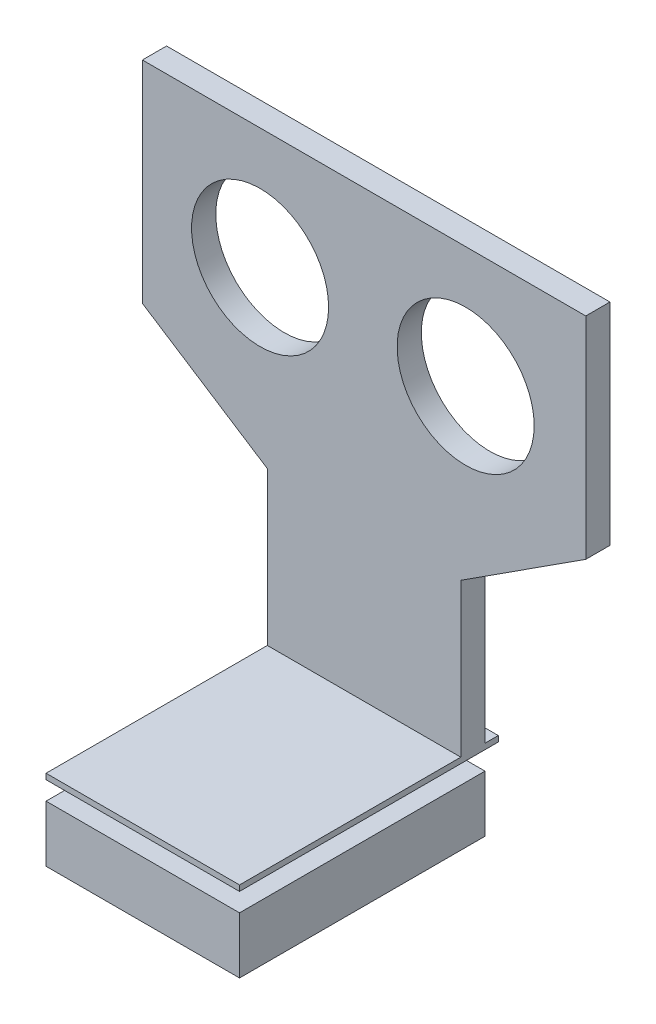
ISO-10303-21;
HEADER;
FILE_DESCRIPTION(('STEP AP214'),'2;1');
FILE_NAME('part.step','',(''),(''),'','','');
FILE_SCHEMA(('AUTOMOTIVE_DESIGN { 1 0 10303 214 1 1 1 1 }'));
ENDSEC;
DATA;
#1=APPLICATION_CONTEXT('core data for automotive mechanical design processes');
#2=APPLICATION_PROTOCOL_DEFINITION('international standard','automotive_design',2000,#1);
#3=PRODUCT_CONTEXT('',#1,'mechanical');
#4=PRODUCT('Part','Part','',(#3));
#5=PRODUCT_RELATED_PRODUCT_CATEGORY('part','',(#4));
#6=PRODUCT_DEFINITION_FORMATION('','',#4);
#7=PRODUCT_DEFINITION_CONTEXT('part definition',#1,'design');
#8=PRODUCT_DEFINITION('design','',#6,#7);
#9=PRODUCT_DEFINITION_SHAPE('','',#8);
#10=(LENGTH_UNIT() NAMED_UNIT(*) SI_UNIT(.MILLI.,.METRE.));
#11=(NAMED_UNIT(*) PLANE_ANGLE_UNIT() SI_UNIT($,.RADIAN.));
#12=(NAMED_UNIT(*) SI_UNIT($,.STERADIAN.) SOLID_ANGLE_UNIT());
#13=UNCERTAINTY_MEASURE_WITH_UNIT(LENGTH_MEASURE(1.E-05),#10,'distance_accuracy_value','');
#14=(GEOMETRIC_REPRESENTATION_CONTEXT(3) GLOBAL_UNCERTAINTY_ASSIGNED_CONTEXT((#13)) GLOBAL_UNIT_ASSIGNED_CONTEXT((#10,
#11,#12)) REPRESENTATION_CONTEXT('',''));
#15=CARTESIAN_POINT('',(0.,0.,0.));
#16=DIRECTION('',(0.,0.,1.));
#17=DIRECTION('',(1.,0.,0.));
#18=AXIS2_PLACEMENT_3D('',#15,#16,#17);
#19=CARTESIAN_POINT('',(15.5,-10.,3.));
#20=DIRECTION('',(1.,0.,0.));
#21=DIRECTION('',(0.,1.,0.));
#22=AXIS2_PLACEMENT_3D('',#19,#20,#21);
#23=PLANE('',#22);
#24=DIRECTION('',(0.,0.,-1.));
#25=VECTOR('',#24,1.);
#26=CARTESIAN_POINT('',(15.5,-29.7,3.));
#27=LINE('',#26,#25);
#28=CARTESIAN_POINT('',(15.5,-29.7,30.4499999999999));
#29=VERTEX_POINT('',#28);
#30=CARTESIAN_POINT('',(15.5,-29.7,-1.65000000000008));
#31=VERTEX_POINT('',#30);
#32=EDGE_CURVE('E54',#29,#31,#27,.T.);
#33=ORIENTED_EDGE('',*,*,#32,.F.);
#34=DIRECTION('',(0.,-1.,0.));
#35=VECTOR('',#34,1.);
#36=CARTESIAN_POINT('',(15.5,-32.,30.4499999999999));
#37=LINE('',#36,#35);
#38=CARTESIAN_POINT('',(15.5,-29.,30.4499999999999));
#39=VERTEX_POINT('',#38);
#40=EDGE_CURVE('E173',#39,#29,#37,.T.);
#41=ORIENTED_EDGE('',*,*,#40,.F.);
#42=DIRECTION('',(0.,0.,-1.));
#43=VECTOR('',#42,1.);
#44=CARTESIAN_POINT('',(15.5,-29.,54.6367732448955));
#45=LINE('',#44,#43);
#46=CARTESIAN_POINT('',(15.5,-29.,3.));
#47=VERTEX_POINT('',#46);
#48=EDGE_CURVE('E145',#39,#47,#45,.T.);
#49=ORIENTED_EDGE('',*,*,#48,.T.);
#50=DIRECTION('',(0.,-1.,0.));
#51=VECTOR('',#50,1.);
#52=CARTESIAN_POINT('',(15.5,-10.,3.));
#53=LINE('',#52,#51);
#54=CARTESIAN_POINT('',(15.5,-10.,3.));
#55=VERTEX_POINT('',#54);
#56=EDGE_CURVE('E175',#55,#47,#53,.T.);
#57=ORIENTED_EDGE('',*,*,#56,.F.);
#58=DIRECTION('',(0.,0.,-1.));
#59=VECTOR('',#58,1.);
#60=CARTESIAN_POINT('',(15.5,-10.,3.));
#61=LINE('',#60,#59);
#62=CARTESIAN_POINT('',(15.5,-10.,0.));
#63=VERTEX_POINT('',#62);
#64=EDGE_CURVE('E184',#55,#63,#61,.T.);
#65=ORIENTED_EDGE('',*,*,#64,.T.);
#66=DIRECTION('',(0.,-1.,0.));
#67=VECTOR('',#66,1.);
#68=CARTESIAN_POINT('',(15.5,-10.,0.));
#69=LINE('',#68,#67);
#70=CARTESIAN_POINT('',(15.5,-29.,0.));
#71=VERTEX_POINT('',#70);
#72=EDGE_CURVE('E140',#63,#71,#69,.T.);
#73=ORIENTED_EDGE('',*,*,#72,.T.);
#74=CARTESIAN_POINT('',(15.5,-29.,-1.65000000000008));
#75=VERTEX_POINT('',#74);
#76=EDGE_CURVE('E136',#71,#75,#45,.T.);
#77=ORIENTED_EDGE('',*,*,#76,.T.);
#78=DIRECTION('',(0.,-1.,0.));
#79=VECTOR('',#78,1.);
#80=CARTESIAN_POINT('',(15.5,-32.,-1.65000000000008));
#81=LINE('',#80,#79);
#82=EDGE_CURVE('E138',#75,#31,#81,.T.);
#83=ORIENTED_EDGE('',*,*,#82,.T.);
#84=EDGE_LOOP('',(#33,#41,#49,#57,#65,#73,#77,#83));
#85=FACE_BOUND('',#84,.T.);
#86=ADVANCED_FACE('F45',(#85),#23,.F.);
#87=CARTESIAN_POINT('',(39.5,-9.99999999999999,3.));
#88=DIRECTION('',(-1.,0.,0.));
#89=DIRECTION('',(0.,-1.,0.));
#90=AXIS2_PLACEMENT_3D('',#87,#88,#89);
#91=PLANE('',#90);
#92=DIRECTION('',(0.,0.,1.));
#93=VECTOR('',#92,1.);
#94=CARTESIAN_POINT('',(39.5,-29.7,3.));
#95=LINE('',#94,#93);
#96=CARTESIAN_POINT('',(39.5,-29.7,-1.65000000000033));
#97=VERTEX_POINT('',#96);
#98=CARTESIAN_POINT('',(39.5,-29.7,30.4499999999997));
#99=VERTEX_POINT('',#98);
#100=EDGE_CURVE('E168',#97,#99,#95,.T.);
#101=ORIENTED_EDGE('',*,*,#100,.F.);
#102=DIRECTION('',(0.,-1.,0.));
#103=VECTOR('',#102,1.);
#104=CARTESIAN_POINT('',(39.5,-32.,-1.65000000000033));
#105=LINE('',#104,#103);
#106=CARTESIAN_POINT('',(39.5,-29.,-1.65000000000033));
#107=VERTEX_POINT('',#106);
#108=EDGE_CURVE('E164',#107,#97,#105,.T.);
#109=ORIENTED_EDGE('',*,*,#108,.F.);
#110=DIRECTION('',(0.,0.,-1.));
#111=VECTOR('',#110,1.);
#112=CARTESIAN_POINT('',(39.5,-29.,54.6367732448955));
#113=LINE('',#112,#111);
#114=CARTESIAN_POINT('',(39.5,-29.,0.));
#115=VERTEX_POINT('',#114);
#116=EDGE_CURVE('E157',#115,#107,#113,.T.);
#117=ORIENTED_EDGE('',*,*,#116,.F.);
#118=DIRECTION('',(0.,1.,0.));
#119=VECTOR('',#118,1.);
#120=CARTESIAN_POINT('',(39.5,-9.99999999999999,0.));
#121=LINE('',#120,#119);
#122=CARTESIAN_POINT('',(39.5,-9.99999999999999,0.));
#123=VERTEX_POINT('',#122);
#124=EDGE_CURVE('E152',#115,#123,#121,.T.);
#125=ORIENTED_EDGE('',*,*,#124,.T.);
#126=DIRECTION('',(0.,0.,-1.));
#127=VECTOR('',#126,1.);
#128=CARTESIAN_POINT('',(39.5,-9.99999999999999,3.));
#129=LINE('',#128,#127);
#130=CARTESIAN_POINT('',(39.5,-9.99999999999999,3.));
#131=VERTEX_POINT('',#130);
#132=EDGE_CURVE('E222',#131,#123,#129,.T.);
#133=ORIENTED_EDGE('',*,*,#132,.F.);
#134=DIRECTION('',(0.,1.,0.));
#135=VECTOR('',#134,1.);
#136=CARTESIAN_POINT('',(39.5,-9.99999999999999,3.));
#137=LINE('',#136,#135);
#138=CARTESIAN_POINT('',(39.5,-29.,3.));
#139=VERTEX_POINT('',#138);
#140=EDGE_CURVE('E189',#139,#131,#137,.T.);
#141=ORIENTED_EDGE('',*,*,#140,.F.);
#142=CARTESIAN_POINT('',(39.5,-29.,30.4499999999997));
#143=VERTEX_POINT('',#142);
#144=EDGE_CURVE('E80',#143,#139,#113,.T.);
#145=ORIENTED_EDGE('',*,*,#144,.F.);
#146=DIRECTION('',(0.,-1.,0.));
#147=VECTOR('',#146,1.);
#148=CARTESIAN_POINT('',(39.5,-32.,30.4499999999997));
#149=LINE('',#148,#147);
#150=EDGE_CURVE('E48',#143,#99,#149,.T.);
#151=ORIENTED_EDGE('',*,*,#150,.T.);
#152=EDGE_LOOP('',(#101,#109,#117,#125,#133,#141,#145,#151));
#153=FACE_BOUND('',#152,.T.);
#154=ADVANCED_FACE('F263',(#153),#91,.F.);
#155=CARTESIAN_POINT('',(33.1057043892065,-41.,-1.65000000000026));
#156=DIRECTION('',(0.,0.,1.));
#157=DIRECTION('',(1.,0.,0.));
#158=AXIS2_PLACEMENT_3D('',#155,#156,#157);
#159=PLANE('',#158);
#160=DIRECTION('',(1.,0.,0.));
#161=VECTOR('',#160,1.);
#162=CARTESIAN_POINT('',(33.1057043892065,-29.7,-1.65000000000026));
#163=LINE('',#162,#161);
#164=EDGE_CURVE('E70',#31,#97,#163,.T.);
#165=ORIENTED_EDGE('',*,*,#164,.F.);
#166=ORIENTED_EDGE('',*,*,#82,.F.);
#167=DIRECTION('',(-1.,0.,0.));
#168=VECTOR('',#167,1.);
#169=CARTESIAN_POINT('',(15.5000000000003,-29.,-1.65000000000008));
#170=LINE('',#169,#168);
#171=EDGE_CURVE('E150',#107,#75,#170,.T.);
#172=ORIENTED_EDGE('',*,*,#171,.F.);
#173=ORIENTED_EDGE('',*,*,#108,.T.);
#174=EDGE_LOOP('',(#165,#166,#172,#173));
#175=FACE_BOUND('',#174,.T.);
#176=ADVANCED_FACE('F148',(#175),#159,.F.);
#177=CARTESIAN_POINT('',(33.1057043892068,-41.,30.4499999999997));
#178=DIRECTION('',(0.,0.,-1.));
#179=DIRECTION('',(-1.,0.,0.));
#180=AXIS2_PLACEMENT_3D('',#177,#178,#179);
#181=PLANE('',#180);
#182=DIRECTION('',(-1.,0.,0.));
#183=VECTOR('',#182,1.);
#184=CARTESIAN_POINT('',(33.1057043892068,-29.7,30.4499999999997));
#185=LINE('',#184,#183);
#186=EDGE_CURVE('E170',#99,#29,#185,.T.);
#187=ORIENTED_EDGE('',*,*,#186,.F.);
#188=ORIENTED_EDGE('',*,*,#150,.F.);
#189=DIRECTION('',(-1.,0.,0.));
#190=VECTOR('',#189,1.);
#191=CARTESIAN_POINT('',(15.4999999999998,-29.,30.4499999999999));
#192=LINE('',#191,#190);
#193=EDGE_CURVE('E166',#143,#39,#192,.T.);
#194=ORIENTED_EDGE('',*,*,#193,.T.);
#195=ORIENTED_EDGE('',*,*,#40,.T.);
#196=EDGE_LOOP('',(#187,#188,#194,#195));
#197=FACE_BOUND('',#196,.T.);
#198=ADVANCED_FACE('F265',(#197),#181,.F.);
#199=CARTESIAN_POINT('',(0.,0.,3.));
#200=DIRECTION('',(0.,0.,-1.));
#201=DIRECTION('',(-1.,0.,0.));
#202=AXIS2_PLACEMENT_3D('',#199,#200,#201);
#203=PLANE('',#202);
#204=ORIENTED_EDGE('',*,*,#56,.T.);
#205=DIRECTION('',(1.,0.,0.));
#206=VECTOR('',#205,1.);
#207=CARTESIAN_POINT('',(0.,-29.,3.));
#208=LINE('',#207,#206);
#209=EDGE_CURVE('E180',#47,#139,#208,.T.);
#210=ORIENTED_EDGE('',*,*,#209,.T.);
#211=ORIENTED_EDGE('',*,*,#140,.T.);
#212=DIRECTION('',(0.840296648224245,0.542126869822093,0.));
#213=VECTOR('',#212,1.);
#214=CARTESIAN_POINT('',(39.5,-9.99999999999999,3.));
#215=LINE('',#214,#213);
#216=CARTESIAN_POINT('',(55.,0.,3.));
#217=VERTEX_POINT('',#216);
#218=EDGE_CURVE('E208',#131,#217,#215,.T.);
#219=ORIENTED_EDGE('',*,*,#218,.T.);
#220=DIRECTION('',(0.,1.,0.));
#221=VECTOR('',#220,1.);
#222=CARTESIAN_POINT('',(55.,0.,3.));
#223=LINE('',#222,#221);
#224=CARTESIAN_POINT('',(55.,26.1500000000002,3.));
#225=VERTEX_POINT('',#224);
#226=EDGE_CURVE('E210',#217,#225,#223,.T.);
#227=ORIENTED_EDGE('',*,*,#226,.T.);
#228=DIRECTION('',(-1.,0.,0.));
#229=VECTOR('',#228,1.);
#230=CARTESIAN_POINT('',(0.,26.1500000000002,3.));
#231=LINE('',#230,#229);
#232=CARTESIAN_POINT('',(0.,26.1500000000002,3.));
#233=VERTEX_POINT('',#232);
#234=EDGE_CURVE('E212',#225,#233,#231,.T.);
#235=ORIENTED_EDGE('',*,*,#234,.T.);
#236=DIRECTION('',(0.,-1.,0.));
#237=VECTOR('',#236,1.);
#238=CARTESIAN_POINT('',(0.,0.,3.));
#239=LINE('',#238,#237);
#240=CARTESIAN_POINT('',(0.,0.,3.));
#241=VERTEX_POINT('',#240);
#242=EDGE_CURVE('E205',#233,#241,#239,.T.);
#243=ORIENTED_EDGE('',*,*,#242,.T.);
#244=DIRECTION('',(0.840296648224244,-0.542126869822093,0.));
#245=VECTOR('',#244,1.);
#246=CARTESIAN_POINT('',(15.5,-10.,3.));
#247=LINE('',#246,#245);
#248=EDGE_CURVE('E203',#241,#55,#247,.T.);
#249=ORIENTED_EDGE('',*,*,#248,.T.);
#250=EDGE_LOOP('',(#204,#210,#211,#219,#227,#235,#243,#249));
#251=FACE_BOUND('',#250,.T.);
#252=CARTESIAN_POINT('',(40.1000000000004,11.1500000000002,3.));
#253=DIRECTION('',(0.,0.,1.));
#254=DIRECTION('',(1.,0.,0.));
#255=AXIS2_PLACEMENT_3D('',#252,#253,#254);
#256=CIRCLE('',#255,8.49999999999994);
#257=CARTESIAN_POINT('',(48.6000000000004,11.1500000000002,3.));
#258=VERTEX_POINT('',#257);
#259=EDGE_CURVE('E192',#258,#258,#256,.T.);
#260=ORIENTED_EDGE('',*,*,#259,.F.);
#261=EDGE_LOOP('',(#260));
#262=FACE_BOUND('',#261,.T.);
#263=CARTESIAN_POINT('',(14.6000000000005,11.1500000000002,3.));
#264=DIRECTION('',(0.,0.,1.));
#265=DIRECTION('',(1.,0.,0.));
#266=AXIS2_PLACEMENT_3D('',#263,#264,#265);
#267=CIRCLE('',#266,8.49999999999995);
#268=CARTESIAN_POINT('',(23.1000000000004,11.1500000000002,3.));
#269=VERTEX_POINT('',#268);
#270=EDGE_CURVE('E187',#269,#269,#267,.T.);
#271=ORIENTED_EDGE('',*,*,#270,.F.);
#272=EDGE_LOOP('',(#271));
#273=FACE_BOUND('',#272,.T.);
#274=ADVANCED_FACE('F245',(#251,#262,#273),#203,.F.);
#275=CARTESIAN_POINT('',(0.,0.,0.));
#276=DIRECTION('',(0.,0.,-1.));
#277=DIRECTION('',(-1.,0.,0.));
#278=AXIS2_PLACEMENT_3D('',#275,#276,#277);
#279=PLANE('',#278);
#280=DIRECTION('',(1.,0.,0.));
#281=VECTOR('',#280,1.);
#282=CARTESIAN_POINT('',(0.,-29.,0.));
#283=LINE('',#282,#281);
#284=EDGE_CURVE('E161',#71,#115,#283,.T.);
#285=ORIENTED_EDGE('',*,*,#284,.F.);
#286=ORIENTED_EDGE('',*,*,#72,.F.);
#287=DIRECTION('',(0.840296648224244,-0.542126869822093,0.));
#288=VECTOR('',#287,1.);
#289=CARTESIAN_POINT('',(15.5,-10.,0.));
#290=LINE('',#289,#288);
#291=CARTESIAN_POINT('',(0.,0.,0.));
#292=VERTEX_POINT('',#291);
#293=EDGE_CURVE('E196',#292,#63,#290,.T.);
#294=ORIENTED_EDGE('',*,*,#293,.F.);
#295=DIRECTION('',(0.,-1.,0.));
#296=VECTOR('',#295,1.);
#297=CARTESIAN_POINT('',(0.,0.,0.));
#298=LINE('',#297,#296);
#299=CARTESIAN_POINT('',(0.,26.1500000000002,0.));
#300=VERTEX_POINT('',#299);
#301=EDGE_CURVE('E229',#300,#292,#298,.T.);
#302=ORIENTED_EDGE('',*,*,#301,.F.);
#303=DIRECTION('',(-1.,0.,0.));
#304=VECTOR('',#303,1.);
#305=CARTESIAN_POINT('',(0.,26.1500000000002,0.));
#306=LINE('',#305,#304);
#307=CARTESIAN_POINT('',(55.,26.1500000000002,0.));
#308=VERTEX_POINT('',#307);
#309=EDGE_CURVE('E226',#308,#300,#306,.T.);
#310=ORIENTED_EDGE('',*,*,#309,.F.);
#311=DIRECTION('',(0.,1.,0.));
#312=VECTOR('',#311,1.);
#313=CARTESIAN_POINT('',(55.,0.,0.));
#314=LINE('',#313,#312);
#315=CARTESIAN_POINT('',(55.,0.,0.));
#316=VERTEX_POINT('',#315);
#317=EDGE_CURVE('E223',#316,#308,#314,.T.);
#318=ORIENTED_EDGE('',*,*,#317,.F.);
#319=DIRECTION('',(0.840296648224245,0.542126869822093,0.));
#320=VECTOR('',#319,1.);
#321=CARTESIAN_POINT('',(39.5,-9.99999999999999,0.));
#322=LINE('',#321,#320);
#323=EDGE_CURVE('E220',#123,#316,#322,.T.);
#324=ORIENTED_EDGE('',*,*,#323,.F.);
#325=ORIENTED_EDGE('',*,*,#124,.F.);
#326=EDGE_LOOP('',(#285,#286,#294,#302,#310,#318,#324,#325));
#327=FACE_BOUND('',#326,.T.);
#328=CARTESIAN_POINT('',(40.1000000000004,11.1500000000002,0.));
#329=DIRECTION('',(0.,0.,1.));
#330=DIRECTION('',(1.,0.,0.));
#331=AXIS2_PLACEMENT_3D('',#328,#329,#330);
#332=CIRCLE('',#331,8.49999999999994);
#333=CARTESIAN_POINT('',(48.6000000000004,11.1500000000002,0.));
#334=VERTEX_POINT('',#333);
#335=EDGE_CURVE('E197',#334,#334,#332,.T.);
#336=ORIENTED_EDGE('',*,*,#335,.T.);
#337=EDGE_LOOP('',(#336));
#338=FACE_BOUND('',#337,.T.);
#339=CARTESIAN_POINT('',(14.6000000000005,11.1500000000002,0.));
#340=DIRECTION('',(0.,0.,1.));
#341=DIRECTION('',(1.,0.,0.));
#342=AXIS2_PLACEMENT_3D('',#339,#340,#341);
#343=CIRCLE('',#342,8.49999999999995);
#344=CARTESIAN_POINT('',(23.1000000000004,11.1500000000002,0.));
#345=VERTEX_POINT('',#344);
#346=EDGE_CURVE('E193',#345,#345,#343,.T.);
#347=ORIENTED_EDGE('',*,*,#346,.T.);
#348=EDGE_LOOP('',(#347));
#349=FACE_BOUND('',#348,.T.);
#350=ADVANCED_FACE('F258',(#327,#338,#349),#279,.T.);
#351=CARTESIAN_POINT('',(15.5,-10.,3.));
#352=DIRECTION('',(0.542126869822093,0.840296648224244,0.));
#353=DIRECTION('',(-0.840296648224244,0.542126869822093,0.));
#354=AXIS2_PLACEMENT_3D('',#351,#352,#353);
#355=PLANE('',#354);
#356=ORIENTED_EDGE('',*,*,#293,.T.);
#357=ORIENTED_EDGE('',*,*,#64,.F.);
#358=ORIENTED_EDGE('',*,*,#248,.F.);
#359=DIRECTION('',(0.,0.,-1.));
#360=VECTOR('',#359,1.);
#361=CARTESIAN_POINT('',(0.,0.,3.));
#362=LINE('',#361,#360);
#363=EDGE_CURVE('E217',#241,#292,#362,.T.);
#364=ORIENTED_EDGE('',*,*,#363,.T.);
#365=EDGE_LOOP('',(#356,#357,#358,#364));
#366=FACE_BOUND('',#365,.T.);
#367=ADVANCED_FACE('F253',(#366),#355,.F.);
#368=CARTESIAN_POINT('',(39.5,-9.99999999999999,3.));
#369=DIRECTION('',(-0.542126869822093,0.840296648224244,0.));
#370=DIRECTION('',(-0.840296648224245,-0.542126869822093,0.));
#371=AXIS2_PLACEMENT_3D('',#368,#369,#370);
#372=PLANE('',#371);
#373=ORIENTED_EDGE('',*,*,#323,.T.);
#374=DIRECTION('',(0.,0.,-1.));
#375=VECTOR('',#374,1.);
#376=CARTESIAN_POINT('',(55.,0.,3.));
#377=LINE('',#376,#375);
#378=EDGE_CURVE('E225',#217,#316,#377,.T.);
#379=ORIENTED_EDGE('',*,*,#378,.F.);
#380=ORIENTED_EDGE('',*,*,#218,.F.);
#381=ORIENTED_EDGE('',*,*,#132,.T.);
#382=EDGE_LOOP('',(#373,#379,#380,#381));
#383=FACE_BOUND('',#382,.T.);
#384=ADVANCED_FACE('F304',(#383),#372,.F.);
#385=CARTESIAN_POINT('',(55.,0.,3.));
#386=DIRECTION('',(-1.,0.,0.));
#387=DIRECTION('',(0.,0.,1.));
#388=AXIS2_PLACEMENT_3D('',#385,#386,#387);
#389=PLANE('',#388);
#390=ORIENTED_EDGE('',*,*,#317,.T.);
#391=DIRECTION('',(0.,0.,-1.));
#392=VECTOR('',#391,1.);
#393=CARTESIAN_POINT('',(55.,26.1500000000002,3.));
#394=LINE('',#393,#392);
#395=EDGE_CURVE('E228',#225,#308,#394,.T.);
#396=ORIENTED_EDGE('',*,*,#395,.F.);
#397=ORIENTED_EDGE('',*,*,#226,.F.);
#398=ORIENTED_EDGE('',*,*,#378,.T.);
#399=EDGE_LOOP('',(#390,#396,#397,#398));
#400=FACE_BOUND('',#399,.T.);
#401=ADVANCED_FACE('F307',(#400),#389,.F.);
#402=CARTESIAN_POINT('',(0.,26.1500000000002,3.));
#403=DIRECTION('',(0.,-1.,0.));
#404=DIRECTION('',(0.,0.,-1.));
#405=AXIS2_PLACEMENT_3D('',#402,#403,#404);
#406=PLANE('',#405);
#407=ORIENTED_EDGE('',*,*,#309,.T.);
#408=DIRECTION('',(0.,0.,-1.));
#409=VECTOR('',#408,1.);
#410=CARTESIAN_POINT('',(0.,26.1500000000002,3.));
#411=LINE('',#410,#409);
#412=EDGE_CURVE('E200',#233,#300,#411,.T.);
#413=ORIENTED_EDGE('',*,*,#412,.F.);
#414=ORIENTED_EDGE('',*,*,#234,.F.);
#415=ORIENTED_EDGE('',*,*,#395,.T.);
#416=EDGE_LOOP('',(#407,#413,#414,#415));
#417=FACE_BOUND('',#416,.T.);
#418=ADVANCED_FACE('F311',(#417),#406,.F.);
#419=CARTESIAN_POINT('',(0.,0.,3.));
#420=DIRECTION('',(1.,0.,0.));
#421=DIRECTION('',(0.,0.,-1.));
#422=AXIS2_PLACEMENT_3D('',#419,#420,#421);
#423=PLANE('',#422);
#424=ORIENTED_EDGE('',*,*,#301,.T.);
#425=ORIENTED_EDGE('',*,*,#363,.F.);
#426=ORIENTED_EDGE('',*,*,#242,.F.);
#427=ORIENTED_EDGE('',*,*,#412,.T.);
#428=EDGE_LOOP('',(#424,#425,#426,#427));
#429=FACE_BOUND('',#428,.T.);
#430=ADVANCED_FACE('F315',(#429),#423,.F.);
#431=CARTESIAN_POINT('',(40.1000000000004,11.1500000000002,3.));
#432=DIRECTION('',(0.,0.,-1.));
#433=DIRECTION('',(-1.,0.,0.));
#434=AXIS2_PLACEMENT_3D('',#431,#432,#433);
#435=CYLINDRICAL_SURFACE('',#434,8.49999999999994);
#436=ORIENTED_EDGE('',*,*,#259,.T.);
#437=EDGE_LOOP('',(#436));
#438=FACE_BOUND('',#437,.T.);
#439=ORIENTED_EDGE('',*,*,#335,.F.);
#440=EDGE_LOOP('',(#439));
#441=FACE_BOUND('',#440,.T.);
#442=ADVANCED_FACE('F319',(#438,#441),#435,.F.);
#443=CARTESIAN_POINT('',(14.6000000000005,11.1500000000002,3.));
#444=DIRECTION('',(0.,0.,-1.));
#445=DIRECTION('',(-1.,0.,0.));
#446=AXIS2_PLACEMENT_3D('',#443,#444,#445);
#447=CYLINDRICAL_SURFACE('',#446,8.49999999999995);
#448=ORIENTED_EDGE('',*,*,#270,.T.);
#449=EDGE_LOOP('',(#448));
#450=FACE_BOUND('',#449,.T.);
#451=ORIENTED_EDGE('',*,*,#346,.F.);
#452=EDGE_LOOP('',(#451));
#453=FACE_BOUND('',#452,.T.);
#454=ADVANCED_FACE('F276',(#450,#453),#447,.F.);
#455=CARTESIAN_POINT('',(15.5,-29.,54.6367732448955));
#456=DIRECTION('',(0.,1.,0.));
#457=DIRECTION('',(0.,0.,1.));
#458=AXIS2_PLACEMENT_3D('',#455,#456,#457);
#459=PLANE('',#458);
#460=ORIENTED_EDGE('',*,*,#76,.F.);
#461=ORIENTED_EDGE('',*,*,#284,.T.);
#462=ORIENTED_EDGE('',*,*,#116,.T.);
#463=ORIENTED_EDGE('',*,*,#171,.T.);
#464=EDGE_LOOP('',(#460,#461,#462,#463));
#465=FACE_BOUND('',#464,.T.);
#466=ADVANCED_FACE('F155',(#465),#459,.T.);
#467=ORIENTED_EDGE('',*,*,#209,.F.);
#468=ORIENTED_EDGE('',*,*,#48,.F.);
#469=ORIENTED_EDGE('',*,*,#193,.F.);
#470=ORIENTED_EDGE('',*,*,#144,.T.);
#471=EDGE_LOOP('',(#467,#468,#469,#470));
#472=FACE_BOUND('',#471,.T.);
#473=ADVANCED_FACE('F266',(#472),#459,.T.);
#474=CARTESIAN_POINT('',(27.1057043892067,-29.7,19.5999999999998));
#475=DIRECTION('',(0.,-1.,0.));
#476=DIRECTION('',(1.,0.,0.));
#477=AXIS2_PLACEMENT_3D('',#474,#475,#476);
#478=CYLINDRICAL_SURFACE('',#477,2.9);
#479=CARTESIAN_POINT('',(27.1057043892067,-29.7,19.5999999999998));
#480=DIRECTION('',(0.,-1.,0.));
#481=DIRECTION('',(1.,0.,0.));
#482=AXIS2_PLACEMENT_3D('',#479,#480,#481);
#483=CIRCLE('',#482,2.9);
#484=CARTESIAN_POINT('',(30.0057043892067,-29.7,19.5999999999998));
#485=VERTEX_POINT('',#484);
#486=EDGE_CURVE('E159',#485,#485,#483,.T.);
#487=ORIENTED_EDGE('',*,*,#486,.T.);
#488=EDGE_LOOP('',(#487));
#489=FACE_BOUND('',#488,.T.);
#490=CARTESIAN_POINT('',(27.1057043892067,-32.,19.5999999999998));
#491=DIRECTION('',(0.,-1.,0.));
#492=DIRECTION('',(1.,0.,0.));
#493=AXIS2_PLACEMENT_3D('',#490,#491,#492);
#494=CIRCLE('',#493,2.9);
#495=CARTESIAN_POINT('',(30.0057043892067,-32.,19.5999999999998));
#496=VERTEX_POINT('',#495);
#497=EDGE_CURVE('E12',#496,#496,#494,.T.);
#498=ORIENTED_EDGE('',*,*,#497,.F.);
#499=EDGE_LOOP('',(#498));
#500=FACE_BOUND('',#499,.T.);
#501=ADVANCED_FACE('F268',(#489,#500),#478,.T.);
#502=CARTESIAN_POINT('',(27.1057043892067,-29.7,19.5999999999998));
#503=DIRECTION('',(0.,-1.,0.));
#504=DIRECTION('',(1.,0.,0.));
#505=AXIS2_PLACEMENT_3D('',#502,#503,#504);
#506=PLANE('',#505);
#507=ORIENTED_EDGE('',*,*,#486,.F.);
#508=EDGE_LOOP('',(#507));
#509=FACE_BOUND('',#508,.T.);
#510=ORIENTED_EDGE('',*,*,#164,.T.);
#511=ORIENTED_EDGE('',*,*,#100,.T.);
#512=ORIENTED_EDGE('',*,*,#186,.T.);
#513=ORIENTED_EDGE('',*,*,#32,.T.);
#514=EDGE_LOOP('',(#510,#511,#512,#513));
#515=FACE_BOUND('',#514,.T.);
#516=ADVANCED_FACE('F242',(#509,#515),#506,.T.);
#517=CARTESIAN_POINT('',(15.5,-32.,3.));
#518=DIRECTION('',(0.,1.,0.));
#519=DIRECTION('',(-1.,0.,0.));
#520=AXIS2_PLACEMENT_3D('',#517,#518,#519);
#521=PLANE('',#520);
#522=ORIENTED_EDGE('',*,*,#497,.T.);
#523=EDGE_LOOP('',(#522));
#524=FACE_BOUND('',#523,.T.);
#525=ADVANCED_FACE('F290',(#524),#521,.F.);
#526=CLOSED_SHELL('',(#86,#154,#176,#198,#274,#350,#367,#384,#401,#418,#430,#442,#454,#466,#473,
#501,#516,#525));
#527=MANIFOLD_SOLID_BREP('B2',#526);
#528=CARTESIAN_POINT('',(0.,-33.,0.));
#529=DIRECTION('',(0.,-1.,0.));
#530=DIRECTION('',(1.,0.,0.));
#531=AXIS2_PLACEMENT_3D('',#528,#529,#530);
#532=PLANE('',#531);
#533=CARTESIAN_POINT('',(27.1057043892067,-33.,19.5999999999998));
#534=DIRECTION('',(0.,-1.,0.));
#535=DIRECTION('',(1.,0.,0.));
#536=AXIS2_PLACEMENT_3D('',#533,#534,#535);
#537=CIRCLE('',#536,2.9);
#538=CARTESIAN_POINT('',(30.0057043892067,-33.,19.5999999999998));
#539=VERTEX_POINT('',#538);
#540=EDGE_CURVE('E556',#539,#539,#537,.T.);
#541=ORIENTED_EDGE('',*,*,#540,.F.);
#542=EDGE_LOOP('',(#541));
#543=FACE_BOUND('',#542,.T.);
#544=CARTESIAN_POINT('',(27.0254630769181,-33.,13.2749203818659));
#545=DIRECTION('',(0.,-1.,0.));
#546=DIRECTION('',(1.,0.,0.));
#547=AXIS2_PLACEMENT_3D('',#544,#545,#546);
#548=CIRCLE('',#547,2.58479106478861);
#549=CARTESIAN_POINT('',(24.46931660626,-33.,13.6586651787724));
#550=VERTEX_POINT('',#549);
#551=CARTESIAN_POINT('',(29.590521877766,-33.,13.5936964738241));
#552=VERTEX_POINT('',#551);
#553=EDGE_CURVE('E566',#550,#552,#548,.T.);
#554=ORIENTED_EDGE('',*,*,#553,.T.);
#555=CARTESIAN_POINT('',(27.1057043892067,-33.,19.5999999999998));
#556=DIRECTION('',(0.,-1.,0.));
#557=DIRECTION('',(1.,0.,0.));
#558=AXIS2_PLACEMENT_3D('',#555,#556,#557);
#559=CIRCLE('',#558,6.5);
#560=EDGE_CURVE('E480',#552,#550,#559,.T.);
#561=ORIENTED_EDGE('',*,*,#560,.T.);
#562=EDGE_LOOP('',(#554,#561));
#563=FACE_BOUND('',#562,.T.);
#564=ADVANCED_FACE('F464',(#543,#563),#532,.T.);
#565=CARTESIAN_POINT('',(33.1057043892068,-41.,30.4499999999997));
#566=DIRECTION('',(0.,0.,-1.));
#567=DIRECTION('',(-1.,0.,0.));
#568=AXIS2_PLACEMENT_3D('',#565,#566,#567);
#569=PLANE('',#568);
#570=DIRECTION('',(0.,-1.,0.));
#571=VECTOR('',#570,1.);
#572=CARTESIAN_POINT('',(39.5,-32.,30.4499999999997));
#573=LINE('',#572,#571);
#574=CARTESIAN_POINT('',(39.5,-32.,30.4499999999999));
#575=VERTEX_POINT('',#574);
#576=CARTESIAN_POINT('',(39.5,-39.,30.4499999999999));
#577=VERTEX_POINT('',#576);
#578=EDGE_CURVE('E468',#575,#577,#573,.T.);
#579=ORIENTED_EDGE('',*,*,#578,.F.);
#580=DIRECTION('',(-1.,0.,0.));
#581=VECTOR('',#580,1.);
#582=CARTESIAN_POINT('',(33.1057043892068,-32.,30.4499999999997));
#583=LINE('',#582,#581);
#584=CARTESIAN_POINT('',(15.5,-32.,30.4499999999999));
#585=VERTEX_POINT('',#584);
#586=EDGE_CURVE('E552',#575,#585,#583,.T.);
#587=ORIENTED_EDGE('',*,*,#586,.T.);
#588=DIRECTION('',(0.,-1.,0.));
#589=VECTOR('',#588,1.);
#590=CARTESIAN_POINT('',(15.5,-32.,30.4499999999999));
#591=LINE('',#590,#589);
#592=CARTESIAN_POINT('',(15.5,-39.,30.4499999999999));
#593=VERTEX_POINT('',#592);
#594=EDGE_CURVE('E473',#585,#593,#591,.T.);
#595=ORIENTED_EDGE('',*,*,#594,.T.);
#596=DIRECTION('',(1.,0.,0.));
#597=VECTOR('',#596,1.);
#598=CARTESIAN_POINT('',(15.5,-39.,30.4499999999999));
#599=LINE('',#598,#597);
#600=EDGE_CURVE('E541',#593,#577,#599,.T.);
#601=ORIENTED_EDGE('',*,*,#600,.T.);
#602=EDGE_LOOP('',(#579,#587,#595,#601));
#603=FACE_BOUND('',#602,.T.);
#604=ADVANCED_FACE('F564',(#603),#569,.F.);
#605=CARTESIAN_POINT('',(15.5,-33.,0.));
#606=DIRECTION('',(0.,0.,1.));
#607=DIRECTION('',(1.,0.,0.));
#608=AXIS2_PLACEMENT_3D('',#605,#606,#607);
#609=PLANE('',#608);
#610=DIRECTION('',(1.,0.,0.));
#611=VECTOR('',#610,1.);
#612=CARTESIAN_POINT('',(15.5,-32.,0.));
#613=LINE('',#612,#611);
#614=CARTESIAN_POINT('',(15.5,-32.,0.));
#615=VERTEX_POINT('',#614);
#616=CARTESIAN_POINT('',(39.5,-32.,0.));
#617=VERTEX_POINT('',#616);
#618=EDGE_CURVE('E524',#615,#617,#613,.T.);
#619=ORIENTED_EDGE('',*,*,#618,.T.);
#620=DIRECTION('',(0.,1.,0.));
#621=VECTOR('',#620,1.);
#622=CARTESIAN_POINT('',(39.5,-33.,0.));
#623=LINE('',#622,#621);
#624=CARTESIAN_POINT('',(39.5,-39.,0.));
#625=VERTEX_POINT('',#624);
#626=EDGE_CURVE('E519',#625,#617,#623,.T.);
#627=ORIENTED_EDGE('',*,*,#626,.F.);
#628=DIRECTION('',(-1.,0.,0.));
#629=VECTOR('',#628,1.);
#630=CARTESIAN_POINT('',(15.5,-39.,0.));
#631=LINE('',#630,#629);
#632=CARTESIAN_POINT('',(15.5,-39.,0.));
#633=VERTEX_POINT('',#632);
#634=EDGE_CURVE('E523',#625,#633,#631,.T.);
#635=ORIENTED_EDGE('',*,*,#634,.T.);
#636=DIRECTION('',(0.,1.,0.));
#637=VECTOR('',#636,1.);
#638=CARTESIAN_POINT('',(15.5,-33.,0.));
#639=LINE('',#638,#637);
#640=EDGE_CURVE('E527',#633,#615,#639,.T.);
#641=ORIENTED_EDGE('',*,*,#640,.T.);
#642=EDGE_LOOP('',(#619,#627,#635,#641));
#643=FACE_BOUND('',#642,.T.);
#644=ADVANCED_FACE('F521',(#643),#609,.F.);
#645=CARTESIAN_POINT('',(39.5,-9.99999999999999,3.));
#646=DIRECTION('',(-1.,0.,0.));
#647=DIRECTION('',(0.,-1.,0.));
#648=AXIS2_PLACEMENT_3D('',#645,#646,#647);
#649=PLANE('',#648);
#650=ORIENTED_EDGE('',*,*,#626,.T.);
#651=DIRECTION('',(0.,0.,1.));
#652=VECTOR('',#651,1.);
#653=CARTESIAN_POINT('',(39.5,-32.,3.));
#654=LINE('',#653,#652);
#655=EDGE_CURVE('E488',#617,#575,#654,.T.);
#656=ORIENTED_EDGE('',*,*,#655,.T.);
#657=ORIENTED_EDGE('',*,*,#578,.T.);
#658=DIRECTION('',(0.,0.,-1.));
#659=VECTOR('',#658,1.);
#660=CARTESIAN_POINT('',(39.5,-39.,30.4499999999999));
#661=LINE('',#660,#659);
#662=EDGE_CURVE('E534',#577,#625,#661,.T.);
#663=ORIENTED_EDGE('',*,*,#662,.T.);
#664=EDGE_LOOP('',(#650,#656,#657,#663));
#665=FACE_BOUND('',#664,.T.);
#666=ADVANCED_FACE('F539',(#665),#649,.F.);
#667=CARTESIAN_POINT('',(15.5,-10.,3.));
#668=DIRECTION('',(1.,0.,0.));
#669=DIRECTION('',(0.,1.,0.));
#670=AXIS2_PLACEMENT_3D('',#667,#668,#669);
#671=PLANE('',#670);
#672=ORIENTED_EDGE('',*,*,#594,.F.);
#673=DIRECTION('',(0.,0.,-1.));
#674=VECTOR('',#673,1.);
#675=CARTESIAN_POINT('',(15.5,-32.,3.));
#676=LINE('',#675,#674);
#677=EDGE_CURVE('E553',#585,#615,#676,.T.);
#678=ORIENTED_EDGE('',*,*,#677,.T.);
#679=ORIENTED_EDGE('',*,*,#640,.F.);
#680=DIRECTION('',(0.,0.,1.));
#681=VECTOR('',#680,1.);
#682=CARTESIAN_POINT('',(15.5,-39.,30.4499999999999));
#683=LINE('',#682,#681);
#684=EDGE_CURVE('E537',#633,#593,#683,.T.);
#685=ORIENTED_EDGE('',*,*,#684,.T.);
#686=EDGE_LOOP('',(#672,#678,#679,#685));
#687=FACE_BOUND('',#686,.T.);
#688=ADVANCED_FACE('F466',(#687),#671,.F.);
#689=CARTESIAN_POINT('',(27.1057043892067,-33.,19.5999999999998));
#690=DIRECTION('',(0.,1.,0.));
#691=DIRECTION('',(-1.,0.,0.));
#692=AXIS2_PLACEMENT_3D('',#689,#690,#691);
#693=CYLINDRICAL_SURFACE('',#692,2.9);
#694=ORIENTED_EDGE('',*,*,#540,.T.);
#695=EDGE_LOOP('',(#694));
#696=FACE_BOUND('',#695,.T.);
#697=CARTESIAN_POINT('',(27.1057043892067,-32.,19.5999999999998));
#698=DIRECTION('',(0.,-1.,0.));
#699=DIRECTION('',(1.,0.,0.));
#700=AXIS2_PLACEMENT_3D('',#697,#698,#699);
#701=CIRCLE('',#700,2.9);
#702=CARTESIAN_POINT('',(30.0057043892067,-32.,19.5999999999998));
#703=VERTEX_POINT('',#702);
#704=EDGE_CURVE('E43',#703,#703,#701,.T.);
#705=ORIENTED_EDGE('',*,*,#704,.F.);
#706=EDGE_LOOP('',(#705));
#707=FACE_BOUND('',#706,.T.);
#708=ADVANCED_FACE('F601',(#696,#707),#693,.F.);
#709=CARTESIAN_POINT('',(27.1057043892067,-32.,19.5999999999998));
#710=DIRECTION('',(0.,-1.,0.));
#711=DIRECTION('',(1.,0.,0.));
#712=AXIS2_PLACEMENT_3D('',#709,#710,#711);
#713=PLANE('',#712);
#714=ORIENTED_EDGE('',*,*,#704,.T.);
#715=EDGE_LOOP('',(#714));
#716=FACE_BOUND('',#715,.T.);
#717=ORIENTED_EDGE('',*,*,#586,.F.);
#718=ORIENTED_EDGE('',*,*,#655,.F.);
#719=ORIENTED_EDGE('',*,*,#618,.F.);
#720=ORIENTED_EDGE('',*,*,#677,.F.);
#721=EDGE_LOOP('',(#717,#718,#719,#720));
#722=FACE_BOUND('',#721,.T.);
#723=ADVANCED_FACE('F610',(#716,#722),#713,.F.);
#724=CARTESIAN_POINT('',(27.0254630769181,-77.7711555154085,13.2749203818659));
#725=DIRECTION('',(0.,1.,0.));
#726=DIRECTION('',(-1.,0.,0.));
#727=AXIS2_PLACEMENT_3D('',#724,#725,#726);
#728=CYLINDRICAL_SURFACE('',#727,2.58479106478861);
#729=CARTESIAN_POINT('',(27.0254630769181,-39.,13.2749203818659));
#730=DIRECTION('',(0.,1.,0.));
#731=DIRECTION('',(0.,0.,1.));
#732=AXIS2_PLACEMENT_3D('',#729,#730,#731);
#733=CIRCLE('',#732,2.58479106478861);
#734=CARTESIAN_POINT('',(29.5905218777659,-39.,13.5936964738241));
#735=VERTEX_POINT('',#734);
#736=CARTESIAN_POINT('',(24.46931660626,-39.,13.6586651787724));
#737=VERTEX_POINT('',#736);
#738=EDGE_CURVE('E547',#735,#737,#733,.T.);
#739=ORIENTED_EDGE('',*,*,#738,.F.);
#740=DIRECTION('',(0.,1.,0.));
#741=VECTOR('',#740,1.);
#742=CARTESIAN_POINT('',(29.5905218777659,-77.7711555154085,13.5936964738241));
#743=LINE('',#742,#741);
#744=EDGE_CURVE('E543',#735,#552,#743,.T.);
#745=ORIENTED_EDGE('',*,*,#744,.T.);
#746=ORIENTED_EDGE('',*,*,#553,.F.);
#747=DIRECTION('',(0.,1.,0.));
#748=VECTOR('',#747,1.);
#749=CARTESIAN_POINT('',(24.46931660626,-77.7711555154085,13.6586651787724));
#750=LINE('',#749,#748);
#751=EDGE_CURVE('E549',#737,#550,#750,.T.);
#752=ORIENTED_EDGE('',*,*,#751,.F.);
#753=EDGE_LOOP('',(#739,#745,#746,#752));
#754=FACE_BOUND('',#753,.T.);
#755=ADVANCED_FACE('F578',(#754),#728,.F.);
#756=CARTESIAN_POINT('',(27.1057043892067,-77.7711555154085,19.5999999999998));
#757=DIRECTION('',(0.,1.,0.));
#758=DIRECTION('',(-1.,0.,0.));
#759=AXIS2_PLACEMENT_3D('',#756,#757,#758);
#760=CYLINDRICAL_SURFACE('',#759,6.5);
#761=CARTESIAN_POINT('',(27.1057043892067,-39.,19.5999999999998));
#762=DIRECTION('',(0.,1.,0.));
#763=DIRECTION('',(0.,0.,1.));
#764=AXIS2_PLACEMENT_3D('',#761,#762,#763);
#765=CIRCLE('',#764,6.5);
#766=EDGE_CURVE('E548',#737,#735,#765,.T.);
#767=ORIENTED_EDGE('',*,*,#766,.F.);
#768=ORIENTED_EDGE('',*,*,#751,.T.);
#769=ORIENTED_EDGE('',*,*,#560,.F.);
#770=ORIENTED_EDGE('',*,*,#744,.F.);
#771=EDGE_LOOP('',(#767,#768,#769,#770));
#772=FACE_BOUND('',#771,.T.);
#773=ADVANCED_FACE('F581',(#772),#760,.F.);
#774=CARTESIAN_POINT('',(27.1057043892074,-39.,14.3999999999998));
#775=DIRECTION('',(0.,1.,0.));
#776=DIRECTION('',(-1.,0.,0.));
#777=AXIS2_PLACEMENT_3D('',#774,#775,#776);
#778=PLANE('',#777);
#779=ORIENTED_EDGE('',*,*,#738,.T.);
#780=ORIENTED_EDGE('',*,*,#766,.T.);
#781=EDGE_LOOP('',(#779,#780));
#782=FACE_BOUND('',#781,.T.);
#783=ORIENTED_EDGE('',*,*,#634,.F.);
#784=ORIENTED_EDGE('',*,*,#662,.F.);
#785=ORIENTED_EDGE('',*,*,#600,.F.);
#786=ORIENTED_EDGE('',*,*,#684,.F.);
#787=EDGE_LOOP('',(#783,#784,#785,#786));
#788=FACE_BOUND('',#787,.T.);
#789=ADVANCED_FACE('F532',(#782,#788),#778,.F.);
#790=CLOSED_SHELL('',(#564,#604,#644,#666,#688,#708,#723,#755,#773,#789));
#791=MANIFOLD_SOLID_BREP('B6',#790);
#792=ADVANCED_BREP_SHAPE_REPRESENTATION('',(#18,#527,#791),#14);
#793=SHAPE_DEFINITION_REPRESENTATION(#9,#792);
ENDSEC;
END-ISO-10303-21;
